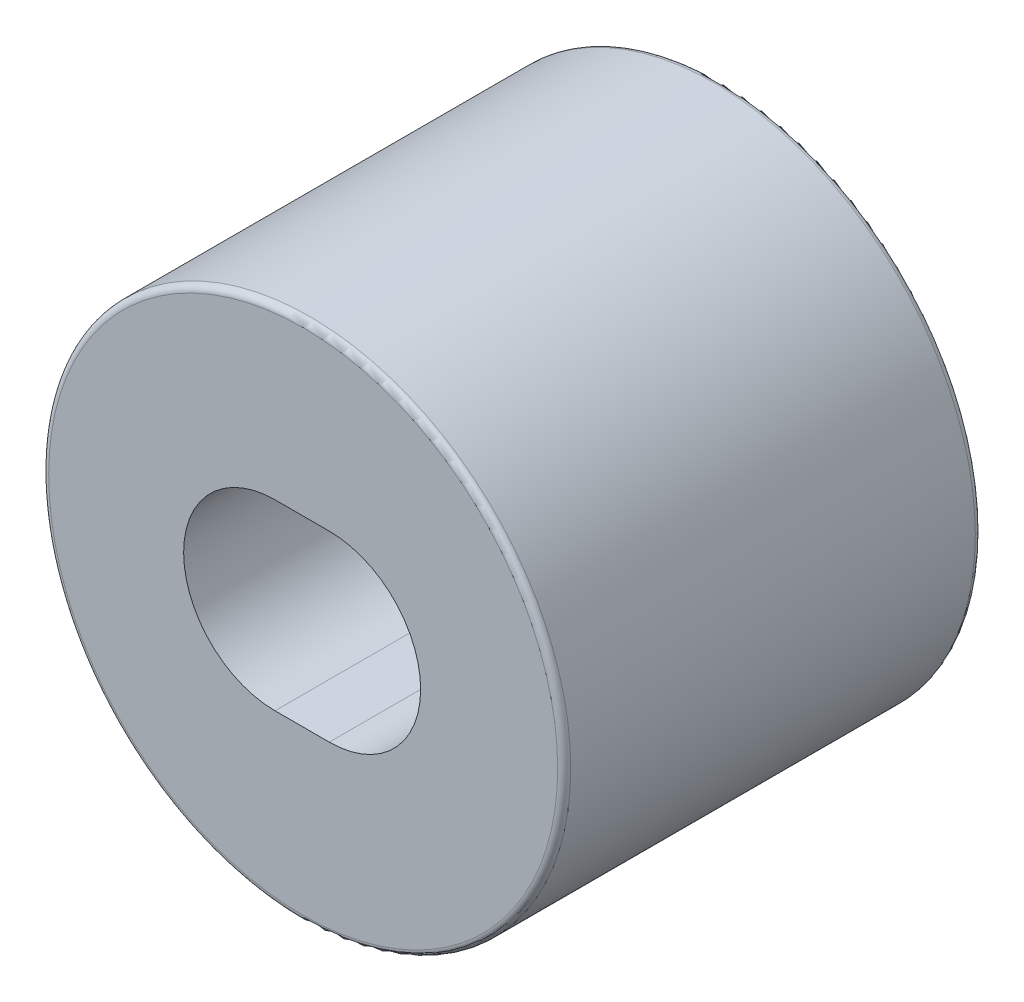
ISO-10303-21;
HEADER;
FILE_DESCRIPTION(('STEP AP214'),'2;1');
FILE_NAME('part.step','',(''),(''),'','','');
FILE_SCHEMA(('AUTOMOTIVE_DESIGN { 1 0 10303 214 1 1 1 1 }'));
ENDSEC;
DATA;
#1=APPLICATION_CONTEXT('core data for automotive mechanical design processes');
#2=APPLICATION_PROTOCOL_DEFINITION('international standard','automotive_design',2000,#1);
#3=PRODUCT_CONTEXT('',#1,'mechanical');
#4=PRODUCT('Part','Part','',(#3));
#5=PRODUCT_RELATED_PRODUCT_CATEGORY('part','',(#4));
#6=PRODUCT_DEFINITION_FORMATION('','',#4);
#7=PRODUCT_DEFINITION_CONTEXT('part definition',#1,'design');
#8=PRODUCT_DEFINITION('design','',#6,#7);
#9=PRODUCT_DEFINITION_SHAPE('','',#8);
#10=(LENGTH_UNIT() NAMED_UNIT(*) SI_UNIT(.MILLI.,.METRE.));
#11=(NAMED_UNIT(*) PLANE_ANGLE_UNIT() SI_UNIT($,.RADIAN.));
#12=(NAMED_UNIT(*) SI_UNIT($,.STERADIAN.) SOLID_ANGLE_UNIT());
#13=UNCERTAINTY_MEASURE_WITH_UNIT(LENGTH_MEASURE(1.E-05),#10,'distance_accuracy_value','');
#14=(GEOMETRIC_REPRESENTATION_CONTEXT(3) GLOBAL_UNCERTAINTY_ASSIGNED_CONTEXT((#13)) GLOBAL_UNIT_ASSIGNED_CONTEXT((#10,
#11,#12)) REPRESENTATION_CONTEXT('',''));
#15=CARTESIAN_POINT('',(0.,0.,0.));
#16=DIRECTION('',(0.,0.,1.));
#17=DIRECTION('',(1.,0.,0.));
#18=AXIS2_PLACEMENT_3D('',#15,#16,#17);
#19=CARTESIAN_POINT('',(0.5,0.,8.));
#20=DIRECTION('',(0.,0.,-1.));
#21=DIRECTION('',(-1.,0.,0.));
#22=AXIS2_PLACEMENT_3D('',#19,#20,#21);
#23=CYLINDRICAL_SURFACE('',#22,1.75);
#24=CARTESIAN_POINT('',(0.5,0.,0.));
#25=DIRECTION('',(0.,0.,1.));
#26=DIRECTION('',(1.,0.,0.));
#27=AXIS2_PLACEMENT_3D('',#24,#25,#26);
#28=CIRCLE('',#27,1.75);
#29=CARTESIAN_POINT('',(0.5,-1.75,0.));
#30=VERTEX_POINT('',#29);
#31=CARTESIAN_POINT('',(0.5,1.75,0.));
#32=VERTEX_POINT('',#31);
#33=EDGE_CURVE('E114',#30,#32,#28,.T.);
#34=ORIENTED_EDGE('',*,*,#33,.F.);
#35=DIRECTION('',(0.,0.,-1.));
#36=VECTOR('',#35,1.);
#37=CARTESIAN_POINT('',(0.5,-1.75,8.));
#38=LINE('',#37,#36);
#39=CARTESIAN_POINT('',(0.5,-1.75,8.));
#40=VERTEX_POINT('',#39);
#41=EDGE_CURVE('E89',#40,#30,#38,.T.);
#42=ORIENTED_EDGE('',*,*,#41,.F.);
#43=CARTESIAN_POINT('',(0.5,0.,8.));
#44=DIRECTION('',(0.,0.,1.));
#45=DIRECTION('',(1.,0.,0.));
#46=AXIS2_PLACEMENT_3D('',#43,#44,#45);
#47=CIRCLE('',#46,1.75);
#48=CARTESIAN_POINT('',(0.5,1.75,8.));
#49=VERTEX_POINT('',#48);
#50=EDGE_CURVE('E107',#40,#49,#47,.T.);
#51=ORIENTED_EDGE('',*,*,#50,.T.);
#52=DIRECTION('',(0.,0.,-1.));
#53=VECTOR('',#52,1.);
#54=CARTESIAN_POINT('',(0.5,1.75,8.));
#55=LINE('',#54,#53);
#56=EDGE_CURVE('E86',#49,#32,#55,.T.);
#57=ORIENTED_EDGE('',*,*,#56,.T.);
#58=EDGE_LOOP('',(#34,#42,#51,#57));
#59=FACE_BOUND('',#58,.T.);
#60=ADVANCED_FACE('F41',(#59),#23,.F.);
#61=CARTESIAN_POINT('',(0.,-1.75,8.));
#62=DIRECTION('',(0.,1.,0.));
#63=DIRECTION('',(0.,0.,1.));
#64=AXIS2_PLACEMENT_3D('',#61,#62,#63);
#65=PLANE('',#64);
#66=DIRECTION('',(1.,0.,0.));
#67=VECTOR('',#66,1.);
#68=CARTESIAN_POINT('',(0.,-1.75,0.));
#69=LINE('',#68,#67);
#70=CARTESIAN_POINT('',(-0.540204200195404,-1.75,0.));
#71=VERTEX_POINT('',#70);
#72=EDGE_CURVE('E99',#71,#30,#69,.T.);
#73=ORIENTED_EDGE('',*,*,#72,.F.);
#74=DIRECTION('',(0.,0.,-1.));
#75=VECTOR('',#74,1.);
#76=CARTESIAN_POINT('',(-0.540204200195404,-1.75,8.));
#77=LINE('',#76,#75);
#78=CARTESIAN_POINT('',(-0.540204200195404,-1.75,8.));
#79=VERTEX_POINT('',#78);
#80=EDGE_CURVE('E94',#79,#71,#77,.T.);
#81=ORIENTED_EDGE('',*,*,#80,.F.);
#82=DIRECTION('',(1.,0.,0.));
#83=VECTOR('',#82,1.);
#84=CARTESIAN_POINT('',(0.,-1.75,8.));
#85=LINE('',#84,#83);
#86=EDGE_CURVE('E97',#79,#40,#85,.T.);
#87=ORIENTED_EDGE('',*,*,#86,.T.);
#88=ORIENTED_EDGE('',*,*,#41,.T.);
#89=EDGE_LOOP('',(#73,#81,#87,#88));
#90=FACE_BOUND('',#89,.T.);
#91=ADVANCED_FACE('F96',(#90),#65,.T.);
#92=CARTESIAN_POINT('',(-0.540204200195404,0.,8.));
#93=DIRECTION('',(0.,0.,-1.));
#94=DIRECTION('',(-1.,0.,0.));
#95=AXIS2_PLACEMENT_3D('',#92,#93,#94);
#96=CYLINDRICAL_SURFACE('',#95,1.75);
#97=CARTESIAN_POINT('',(-0.540204200195404,0.,0.));
#98=DIRECTION('',(0.,0.,1.));
#99=DIRECTION('',(1.,0.,0.));
#100=AXIS2_PLACEMENT_3D('',#97,#98,#99);
#101=CIRCLE('',#100,1.75);
#102=CARTESIAN_POINT('',(-0.540204200195404,1.75,0.));
#103=VERTEX_POINT('',#102);
#104=EDGE_CURVE('E119',#103,#71,#101,.T.);
#105=ORIENTED_EDGE('',*,*,#104,.F.);
#106=DIRECTION('',(0.,0.,-1.));
#107=VECTOR('',#106,1.);
#108=CARTESIAN_POINT('',(-0.540204200195404,1.75,8.));
#109=LINE('',#108,#107);
#110=CARTESIAN_POINT('',(-0.540204200195404,1.75,8.));
#111=VERTEX_POINT('',#110);
#112=EDGE_CURVE('E79',#111,#103,#109,.T.);
#113=ORIENTED_EDGE('',*,*,#112,.F.);
#114=CARTESIAN_POINT('',(-0.540204200195404,0.,8.));
#115=DIRECTION('',(0.,0.,1.));
#116=DIRECTION('',(1.,0.,0.));
#117=AXIS2_PLACEMENT_3D('',#114,#115,#116);
#118=CIRCLE('',#117,1.75);
#119=EDGE_CURVE('E106',#111,#79,#118,.T.);
#120=ORIENTED_EDGE('',*,*,#119,.T.);
#121=ORIENTED_EDGE('',*,*,#80,.T.);
#122=EDGE_LOOP('',(#105,#113,#120,#121));
#123=FACE_BOUND('',#122,.T.);
#124=ADVANCED_FACE('F109',(#123),#96,.F.);
#125=CARTESIAN_POINT('',(0.,1.75,8.));
#126=DIRECTION('',(0.,1.,0.));
#127=DIRECTION('',(0.,0.,1.));
#128=AXIS2_PLACEMENT_3D('',#125,#126,#127);
#129=PLANE('',#128);
#130=DIRECTION('',(1.,0.,0.));
#131=VECTOR('',#130,1.);
#132=CARTESIAN_POINT('',(0.,1.75,0.));
#133=LINE('',#132,#131);
#134=EDGE_CURVE('E121',#103,#32,#133,.T.);
#135=ORIENTED_EDGE('',*,*,#134,.T.);
#136=ORIENTED_EDGE('',*,*,#56,.F.);
#137=DIRECTION('',(1.,0.,0.));
#138=VECTOR('',#137,1.);
#139=CARTESIAN_POINT('',(0.,1.75,8.));
#140=LINE('',#139,#138);
#141=EDGE_CURVE('E63',#111,#49,#140,.T.);
#142=ORIENTED_EDGE('',*,*,#141,.F.);
#143=ORIENTED_EDGE('',*,*,#112,.T.);
#144=EDGE_LOOP('',(#135,#136,#142,#143));
#145=FACE_BOUND('',#144,.T.);
#146=ADVANCED_FACE('F161',(#145),#129,.F.);
#147=CARTESIAN_POINT('',(0.,0.,8.));
#148=DIRECTION('',(0.,0.,-1.));
#149=DIRECTION('',(-1.,0.,0.));
#150=AXIS2_PLACEMENT_3D('',#147,#148,#149);
#151=CYLINDRICAL_SURFACE('',#150,5.);
#152=CARTESIAN_POINT('',(0.,-5.,2.));
#153=CARTESIAN_POINT('',(-0.107493005442891,-4.99999271227085,2.00000985182373));
#154=CARTESIAN_POINT('',(-0.215172564090673,-4.99649294306933,2.00871775208838));
#155=CARTESIAN_POINT('',(-0.427496480417896,-4.98283453100642,2.04324770352124));
#156=CARTESIAN_POINT('',(-0.532131777561248,-4.97265778698877,2.06911627908613));
#157=CARTESIAN_POINT('',(-0.734953922727403,-4.94674209213119,2.13687607805883));
#158=CARTESIAN_POINT('',(-0.833160661616959,-4.93102136364072,2.17871484621673));
#159=CARTESIAN_POINT('',(-1.02107197032837,-4.89556610796078,2.27701917332655));
#160=CARTESIAN_POINT('',(-1.11077947675099,-4.87583297458057,2.33347965491893));
#161=CARTESIAN_POINT('',(-1.28350100757039,-4.83330886170419,2.46223549856094));
#162=CARTESIAN_POINT('',(-1.36606227255021,-4.81042296929191,2.53510665624026));
#163=CARTESIAN_POINT('',(-1.51817500478472,-4.76460576906195,2.69340000347678));
#164=CARTESIAN_POINT('',(-1.58772010713353,-4.74167444453792,2.77882829721174));
#165=CARTESIAN_POINT('',(-1.71487456729288,-4.69722791797136,2.96442807024227));
#166=CARTESIAN_POINT('',(-1.77181498119547,-4.67582115964952,3.0650864860232));
#167=CARTESIAN_POINT('',(-1.86775471903715,-4.63833647186793,3.27553639842004));
#168=CARTESIAN_POINT('',(-1.90676256428583,-4.62225601244176,3.38532352784836));
#169=CARTESIAN_POINT('',(-1.96389882339587,-4.59826357660819,3.6057123335921));
#170=CARTESIAN_POINT('',(-1.98289396580565,-4.59001420355605,3.71605123557621));
#171=CARTESIAN_POINT('',(-2.00217296164003,-4.58164004049144,3.93863499830727));
#172=CARTESIAN_POINT('',(-2.00246601631322,-4.58151125522768,4.05087889462502));
#173=CARTESIAN_POINT('',(-1.98498936750454,-4.58910500279994,4.26575667145804));
#174=CARTESIAN_POINT('',(-1.96847531430514,-4.5962817503845,4.36851571440903));
#175=CARTESIAN_POINT('',(-1.91994688029782,-4.61676187607836,4.56965955600671));
#176=CARTESIAN_POINT('',(-1.88792979480463,-4.63006632321673,4.66804358811031));
#177=CARTESIAN_POINT('',(-1.80869473255107,-4.6615948508853,4.86001783619604));
#178=CARTESIAN_POINT('',(-1.76117986231532,-4.67991379280788,4.95346923905469));
#179=CARTESIAN_POINT('',(-1.65250646073221,-4.7193811638989,5.13141581636156));
#180=CARTESIAN_POINT('',(-1.59134280510084,-4.74053065456849,5.21590760940281));
#181=CARTESIAN_POINT('',(-1.45155059945443,-4.78526736742271,5.380409728802));
#182=CARTESIAN_POINT('',(-1.37193746297063,-4.80891664976152,5.45956872944602));
#183=CARTESIAN_POINT('',(-1.20031442743019,-4.85459824958282,5.60368447800204));
#184=CARTESIAN_POINT('',(-1.10830206533443,-4.87663024445325,5.66863839741029));
#185=CARTESIAN_POINT('',(-0.912077652605843,-4.91714681264548,5.78361744741583));
#186=CARTESIAN_POINT('',(-0.807660491346477,-4.93555270095415,5.83332228119705));
#187=CARTESIAN_POINT('',(-0.591023765482882,-4.96614828328759,5.91416786107806));
#188=CARTESIAN_POINT('',(-0.478808196849674,-4.97834113462382,5.94531803755741));
#189=CARTESIAN_POINT('',(-0.25689588760782,-4.99456139506911,5.9864482954197));
#190=CARTESIAN_POINT('',(-0.147443293985535,-4.99902945833514,5.99757245425356));
#191=CARTESIAN_POINT('',(0.0718453098078168,-5.00068478510631,6.00171310052861));
#192=CARTESIAN_POINT('',(0.181681213223923,-4.99787393582292,5.99473428154751));
#193=CARTESIAN_POINT('',(0.393432739121988,-4.98557567063753,5.96370824744801));
#194=CARTESIAN_POINT('',(0.495482491775475,-4.97639391345523,5.94044201964902));
#195=CARTESIAN_POINT('',(0.694135428060781,-4.952594414055,5.87856429169019));
#196=CARTESIAN_POINT('',(0.790737910224845,-4.93797597356531,5.83995082033132));
#197=CARTESIAN_POINT('',(0.979078785816702,-4.90416594770812,5.74721506032005));
#198=CARTESIAN_POINT('',(1.07057802275541,-4.88484815979804,5.69265452795685));
#199=CARTESIAN_POINT('',(1.24344359124656,-4.84373364745525,5.57005967609436));
#200=CARTESIAN_POINT('',(1.32480584076113,-4.82193593110271,5.50201995707739));
#201=CARTESIAN_POINT('',(1.48072304302882,-4.77645117638112,5.34912998705037));
#202=CARTESIAN_POINT('',(1.55447393380606,-4.75273441425052,5.26346645849379));
#203=CARTESIAN_POINT('',(1.68675119741371,-4.70741672917132,5.08055991699063));
#204=CARTESIAN_POINT('',(1.74527506133751,-4.68581615526511,4.98331499966005));
#205=CARTESIAN_POINT('',(1.84580750193163,-4.64714299907709,4.7785383054059));
#206=CARTESIAN_POINT('',(1.88765059453445,-4.63011630884788,4.67091600078769));
#207=CARTESIAN_POINT('',(1.9522962197053,-4.60323673477932,4.44926634828485));
#208=CARTESIAN_POINT('',(1.97511280526932,-4.59337855695998,4.33524379418757));
#209=CARTESIAN_POINT('',(1.9997156172784,-4.58271759299926,4.11287209822546));
#210=CARTESIAN_POINT('',(2.00289708230287,-4.58131421008172,4.00470516040665));
#211=CARTESIAN_POINT('',(1.99180315927752,-4.58614836033098,3.78945514228671));
#212=CARTESIAN_POINT('',(1.97752998791378,-4.59238492324794,3.68237192609742));
#213=CARTESIAN_POINT('',(1.93307136615365,-4.61126649079021,3.47666781014496));
#214=CARTESIAN_POINT('',(1.90353749357098,-4.62364831827449,3.377879725567));
#215=CARTESIAN_POINT('',(1.83000544849101,-4.65324001232697,3.18662137038652));
#216=CARTESIAN_POINT('',(1.78600328139381,-4.67045121206007,3.09415285310017));
#217=CARTESIAN_POINT('',(1.68187276275973,-4.70898609604492,2.91239038072922));
#218=CARTESIAN_POINT('',(1.62096533515949,-4.73048882313242,2.82358132986952));
#219=CARTESIAN_POINT('',(1.4858921192715,-4.77463804372237,2.65700668279624));
#220=CARTESIAN_POINT('',(1.41172233481812,-4.79728488048407,2.57924442787168));
#221=CARTESIAN_POINT('',(1.24650550627246,-4.84293567087394,2.43179714673638));
#222=CARTESIAN_POINT('',(1.15467600114614,-4.86586757962185,2.36296269310193));
#223=CARTESIAN_POINT('',(0.959900320285778,-4.90800406713717,2.24166295737836));
#224=CARTESIAN_POINT('',(0.856949004547236,-4.92720691092906,2.18920528784747));
#225=CARTESIAN_POINT('',(0.644738062495202,-4.95939714815861,2.10337778480971));
#226=CARTESIAN_POINT('',(0.535631618219695,-4.97249363055028,2.06967067643966));
#227=CARTESIAN_POINT('',(0.31287654628122,-4.99144306209366,2.02136087904573));
#228=CARTESIAN_POINT('',(0.199243525858912,-4.99731899495638,2.0066975632561));
#229=CARTESIAN_POINT('',(0.0569122978909289,-4.99975899504137,2.00060461902173));
#230=CARTESIAN_POINT('',(0.028462688740758,-5.00000192969176,1.99999739137081));
#231=CARTESIAN_POINT('',(0.,-5.,2.));
#232=B_SPLINE_CURVE_WITH_KNOTS('',3,(#152,#153,#154,#155,#156,#157,#158,#159,#160,#161,#162,
#163,#164,#165,#166,#167,#168,#169,#170,#171,#172,#173,#174,#175,#176,#177,#178,#179,#180,#181,
#182,#183,#184,#185,#186,#187,#188,#189,#190,#191,#192,#193,#194,#195,#196,#197,#198,#199,#200,
#201,#202,#203,#204,#205,#206,#207,#208,#209,#210,#211,#212,#213,#214,#215,#216,#217,#218,#219,
#220,#221,#222,#223,#224,#225,#226,#227,#228,#229,#230,#231),.UNSPECIFIED.,.T.,.F.,(4,2,2,2,2,2,
2,2,2,2,2,2,2,2,2,2,2,2,2,2,2,2,2,2,2,2,2,2,2,2,2,2,2,2,2,2,2,2,2,4),(0.,0.322402987893071,
0.645683636007934,0.967911457471581,1.29002753567984,1.62597381700397,1.96208394934411,
2.31315258819217,2.66405423118268,2.99904105308829,3.33386306340488,3.64538328401372,
3.95695787256047,4.27489126298816,4.59294421938183,4.93558349186557,5.27829092839733,
5.62776913162806,5.9770695611379,6.30569184528007,6.63422893570082,6.94800455564366,
7.26182048993797,7.58523513398263,7.90877959498969,8.25368474624414,8.59864669043748,
8.94695045140828,9.29499672645934,9.61799673392748,9.94095572563046,10.2511431854877,
10.5614163580516,10.8894546805669,11.2175920134839,11.5670042353384,11.9165786364053,
12.2596430101332,12.6016125240434,12.686980458968),.UNSPECIFIED.);
#233=CARTESIAN_POINT('',(0.,-5.,2.));
#234=VERTEX_POINT('',#233);
#235=EDGE_CURVE('E11',#234,#234,#232,.T.);
#236=ORIENTED_EDGE('',*,*,#235,.T.);
#237=EDGE_LOOP('',(#236));
#238=FACE_BOUND('',#237,.T.);
#239=CARTESIAN_POINT('',(0.,0.,0.125));
#240=DIRECTION('',(0.,0.,1.));
#241=DIRECTION('',(1.,0.,0.));
#242=AXIS2_PLACEMENT_3D('',#239,#240,#241);
#243=CIRCLE('',#242,5.);
#244=CARTESIAN_POINT('',(5.,0.,0.125));
#245=VERTEX_POINT('',#244);
#246=EDGE_CURVE('E129',#245,#245,#243,.T.);
#247=ORIENTED_EDGE('',*,*,#246,.T.);
#248=EDGE_LOOP('',(#247));
#249=FACE_BOUND('',#248,.T.);
#250=CARTESIAN_POINT('',(0.,0.,7.875));
#251=DIRECTION('',(0.,0.,1.));
#252=DIRECTION('',(1.,0.,0.));
#253=AXIS2_PLACEMENT_3D('',#250,#251,#252);
#254=CIRCLE('',#253,5.);
#255=CARTESIAN_POINT('',(5.,0.,7.875));
#256=VERTEX_POINT('',#255);
#257=EDGE_CURVE('E126',#256,#256,#254,.F.);
#258=ORIENTED_EDGE('',*,*,#257,.T.);
#259=EDGE_LOOP('',(#258));
#260=FACE_BOUND('',#259,.T.);
#261=ADVANCED_FACE('F163',(#238,#249,#260),#151,.T.);
#262=CARTESIAN_POINT('',(0.,0.,8.));
#263=DIRECTION('',(0.,0.,1.));
#264=DIRECTION('',(1.,0.,0.));
#265=AXIS2_PLACEMENT_3D('',#262,#263,#264);
#266=PLANE('',#265);
#267=CARTESIAN_POINT('',(0.,0.,8.));
#268=DIRECTION('',(0.,0.,1.));
#269=DIRECTION('',(1.,0.,0.));
#270=AXIS2_PLACEMENT_3D('',#267,#268,#269);
#271=CIRCLE('',#270,4.875);
#272=CARTESIAN_POINT('',(4.875,0.,8.));
#273=VERTEX_POINT('',#272);
#274=EDGE_CURVE('E55',#273,#273,#271,.T.);
#275=ORIENTED_EDGE('',*,*,#274,.T.);
#276=EDGE_LOOP('',(#275));
#277=FACE_BOUND('',#276,.T.);
#278=ORIENTED_EDGE('',*,*,#50,.F.);
#279=ORIENTED_EDGE('',*,*,#86,.F.);
#280=ORIENTED_EDGE('',*,*,#119,.F.);
#281=ORIENTED_EDGE('',*,*,#141,.T.);
#282=EDGE_LOOP('',(#278,#279,#280,#281));
#283=FACE_BOUND('',#282,.T.);
#284=ADVANCED_FACE('F105',(#277,#283),#266,.T.);
#285=CARTESIAN_POINT('',(0.,0.,0.));
#286=DIRECTION('',(0.,0.,1.));
#287=DIRECTION('',(1.,0.,0.));
#288=AXIS2_PLACEMENT_3D('',#285,#286,#287);
#289=PLANE('',#288);
#290=CARTESIAN_POINT('',(0.,0.,0.));
#291=DIRECTION('',(0.,0.,1.));
#292=DIRECTION('',(1.,0.,0.));
#293=AXIS2_PLACEMENT_3D('',#290,#291,#292);
#294=CIRCLE('',#293,4.875);
#295=CARTESIAN_POINT('',(4.875,0.,0.));
#296=VERTEX_POINT('',#295);
#297=EDGE_CURVE('E132',#296,#296,#294,.F.);
#298=ORIENTED_EDGE('',*,*,#297,.T.);
#299=EDGE_LOOP('',(#298));
#300=FACE_BOUND('',#299,.T.);
#301=ORIENTED_EDGE('',*,*,#33,.T.);
#302=ORIENTED_EDGE('',*,*,#134,.F.);
#303=ORIENTED_EDGE('',*,*,#104,.T.);
#304=ORIENTED_EDGE('',*,*,#72,.T.);
#305=EDGE_LOOP('',(#301,#302,#303,#304));
#306=FACE_BOUND('',#305,.T.);
#307=ADVANCED_FACE('F149',(#300,#306),#289,.F.);
#308=CARTESIAN_POINT('',(0.,0.,0.125));
#309=DIRECTION('',(0.,0.,1.));
#310=DIRECTION('',(1.,0.,0.));
#311=AXIS2_PLACEMENT_3D('',#308,#309,#310);
#312=TOROIDAL_SURFACE('',#311,4.875,0.125);
#313=ORIENTED_EDGE('',*,*,#297,.F.);
#314=EDGE_LOOP('',(#313));
#315=FACE_BOUND('',#314,.T.);
#316=ORIENTED_EDGE('',*,*,#246,.F.);
#317=EDGE_LOOP('',(#316));
#318=FACE_BOUND('',#317,.T.);
#319=ADVANCED_FACE('F140',(#315,#318),#312,.T.);
#320=CARTESIAN_POINT('',(0.,0.,7.875));
#321=DIRECTION('',(0.,0.,1.));
#322=DIRECTION('',(1.,0.,0.));
#323=AXIS2_PLACEMENT_3D('',#320,#321,#322);
#324=TOROIDAL_SURFACE('',#323,4.875,0.125);
#325=ORIENTED_EDGE('',*,*,#257,.F.);
#326=EDGE_LOOP('',(#325));
#327=FACE_BOUND('',#326,.T.);
#328=ORIENTED_EDGE('',*,*,#274,.F.);
#329=EDGE_LOOP('',(#328));
#330=FACE_BOUND('',#329,.T.);
#331=ADVANCED_FACE('F43',(#327,#330),#324,.T.);
#332=CARTESIAN_POINT('',(0.,-2.5,4.));
#333=DIRECTION('',(0.,-1.,0.));
#334=DIRECTION('',(0.,0.,-1.));
#335=AXIS2_PLACEMENT_3D('',#332,#333,#334);
#336=CYLINDRICAL_SURFACE('',#335,2.);
#337=CARTESIAN_POINT('',(0.,-2.5,4.));
#338=DIRECTION('',(0.,-1.,0.));
#339=DIRECTION('',(0.,0.,-1.));
#340=AXIS2_PLACEMENT_3D('',#337,#338,#339);
#341=CIRCLE('',#340,2.);
#342=CARTESIAN_POINT('',(0.,-2.5,2.));
#343=VERTEX_POINT('',#342);
#344=EDGE_CURVE('E117',#343,#343,#341,.T.);
#345=ORIENTED_EDGE('',*,*,#344,.F.);
#346=EDGE_LOOP('',(#345));
#347=FACE_BOUND('',#346,.T.);
#348=ORIENTED_EDGE('',*,*,#235,.F.);
#349=EDGE_LOOP('',(#348));
#350=FACE_BOUND('',#349,.T.);
#351=ADVANCED_FACE('F139',(#347,#350),#336,.F.);
#352=CARTESIAN_POINT('',(0.,-2.5,4.));
#353=DIRECTION('',(0.,-1.,0.));
#354=DIRECTION('',(0.,0.,-1.));
#355=AXIS2_PLACEMENT_3D('',#352,#353,#354);
#356=PLANE('',#355);
#357=ORIENTED_EDGE('',*,*,#344,.T.);
#358=EDGE_LOOP('',(#357));
#359=FACE_BOUND('',#358,.T.);
#360=ADVANCED_FACE('F147',(#359),#356,.T.);
#361=CLOSED_SHELL('',(#60,#91,#124,#146,#261,#284,#307,#319,#331,#351,#360));
#362=MANIFOLD_SOLID_BREP('B2',#361);
#363=ADVANCED_BREP_SHAPE_REPRESENTATION('',(#18,#362),#14);
#364=SHAPE_DEFINITION_REPRESENTATION(#9,#363);
ENDSEC;
END-ISO-10303-21;
